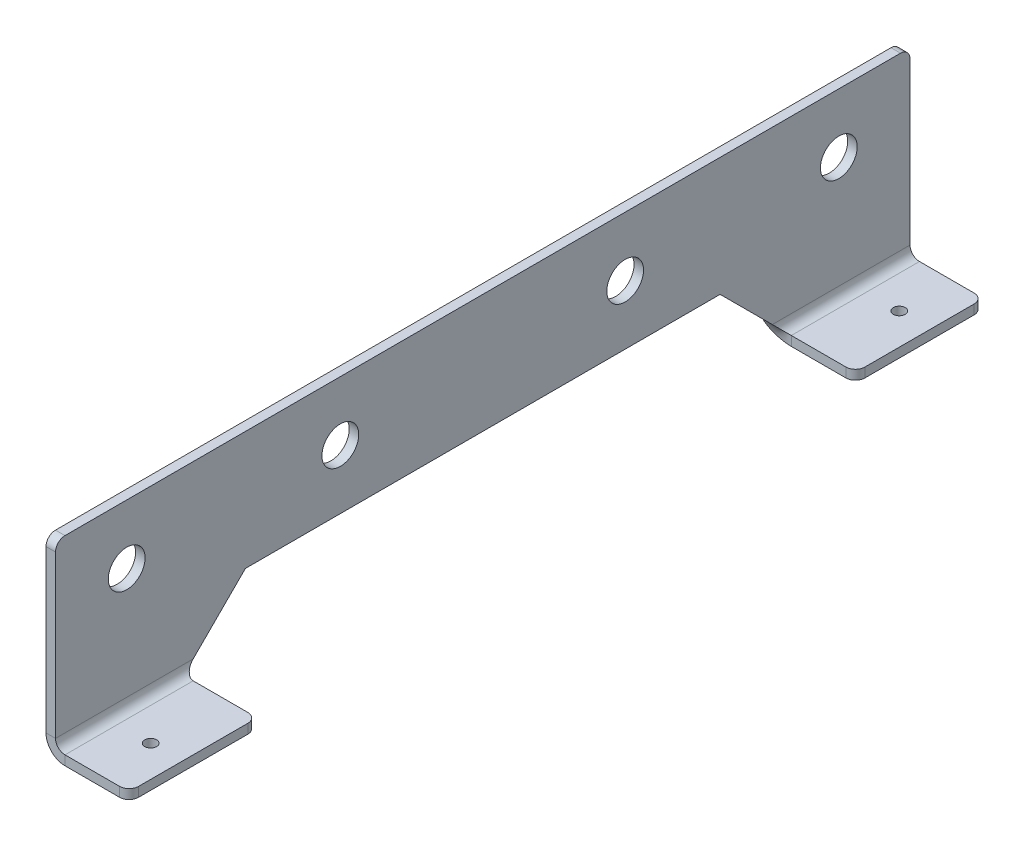
ISO-10303-21;
HEADER;
FILE_DESCRIPTION(('STEP AP214'),'2;1');
FILE_NAME('part.step','',(''),(''),'','','');
FILE_SCHEMA(('AUTOMOTIVE_DESIGN { 1 0 10303 214 1 1 1 1 }'));
ENDSEC;
DATA;
#1=APPLICATION_CONTEXT('core data for automotive mechanical design processes');
#2=APPLICATION_PROTOCOL_DEFINITION('international standard','automotive_design',2000,#1);
#3=PRODUCT_CONTEXT('',#1,'mechanical');
#4=PRODUCT('Part','Part','',(#3));
#5=PRODUCT_RELATED_PRODUCT_CATEGORY('part','',(#4));
#6=PRODUCT_DEFINITION_FORMATION('','',#4);
#7=PRODUCT_DEFINITION_CONTEXT('part definition',#1,'design');
#8=PRODUCT_DEFINITION('design','',#6,#7);
#9=PRODUCT_DEFINITION_SHAPE('','',#8);
#10=(LENGTH_UNIT() NAMED_UNIT(*) SI_UNIT(.MILLI.,.METRE.));
#11=(NAMED_UNIT(*) PLANE_ANGLE_UNIT() SI_UNIT($,.RADIAN.));
#12=(NAMED_UNIT(*) SI_UNIT($,.STERADIAN.) SOLID_ANGLE_UNIT());
#13=UNCERTAINTY_MEASURE_WITH_UNIT(LENGTH_MEASURE(1.E-05),#10,'distance_accuracy_value','');
#14=(GEOMETRIC_REPRESENTATION_CONTEXT(3) GLOBAL_UNCERTAINTY_ASSIGNED_CONTEXT((#13)) GLOBAL_UNIT_ASSIGNED_CONTEXT((#10,
#11,#12)) REPRESENTATION_CONTEXT('',''));
#15=CARTESIAN_POINT('',(0.,0.,0.));
#16=DIRECTION('',(0.,0.,1.));
#17=DIRECTION('',(1.,0.,0.));
#18=AXIS2_PLACEMENT_3D('',#15,#16,#17);
#19=CARTESIAN_POINT('',(4.,-76.,0.));
#20=DIRECTION('',(0.,0.,1.));
#21=DIRECTION('',(0.,1.,0.));
#22=AXIS2_PLACEMENT_3D('',#19,#20,#21);
#23=PLANE('',#22);
#24=DIRECTION('',(0.,-1.,0.));
#25=VECTOR('',#24,1.);
#26=CARTESIAN_POINT('',(0.,-76.,1.11022302462516E-13));
#27=LINE('',#26,#25);
#28=CARTESIAN_POINT('',(0.,-72.,0.));
#29=VERTEX_POINT('',#28);
#30=CARTESIAN_POINT('',(0.,-4.,1.11022302462516E-13));
#31=VERTEX_POINT('',#30);
#32=EDGE_CURVE('E292',#29,#31,#27,.F.);
#33=ORIENTED_EDGE('',*,*,#32,.T.);
#34=DIRECTION('',(1.,0.,0.));
#35=VECTOR('',#34,1.);
#36=CARTESIAN_POINT('',(4.,-4.,0.));
#37=LINE('',#36,#35);
#38=CARTESIAN_POINT('',(4.,-4.,0.));
#39=VERTEX_POINT('',#38);
#40=EDGE_CURVE('E364',#31,#39,#37,.T.);
#41=ORIENTED_EDGE('',*,*,#40,.T.);
#42=DIRECTION('',(0.,1.,0.));
#43=VECTOR('',#42,1.);
#44=CARTESIAN_POINT('',(4.,-76.,0.));
#45=LINE('',#44,#43);
#46=CARTESIAN_POINT('',(4.,-72.,0.));
#47=VERTEX_POINT('',#46);
#48=EDGE_CURVE('E214',#47,#39,#45,.T.);
#49=ORIENTED_EDGE('',*,*,#48,.F.);
#50=DIRECTION('',(1.,0.,0.));
#51=VECTOR('',#50,1.);
#52=CARTESIAN_POINT('',(4.,-72.,0.));
#53=LINE('',#52,#51);
#54=EDGE_CURVE('E345',#29,#47,#53,.T.);
#55=ORIENTED_EDGE('',*,*,#54,.F.);
#56=EDGE_LOOP('',(#33,#41,#49,#55));
#57=FACE_BOUND('',#56,.T.);
#58=ADVANCED_FACE('F36',(#57),#23,.F.);
#59=CARTESIAN_POINT('',(4.,0.,360.));
#60=DIRECTION('',(0.,1.,0.));
#61=DIRECTION('',(0.,0.,-1.));
#62=AXIS2_PLACEMENT_3D('',#59,#60,#61);
#63=PLANE('',#62);
#64=DIRECTION('',(0.,0.,1.));
#65=VECTOR('',#64,1.);
#66=CARTESIAN_POINT('',(0.,0.,360.));
#67=LINE('',#66,#65);
#68=CARTESIAN_POINT('',(0.,0.,356.));
#69=VERTEX_POINT('',#68);
#70=CARTESIAN_POINT('',(0.,0.,4.00000000000011));
#71=VERTEX_POINT('',#70);
#72=EDGE_CURVE('E313',#69,#71,#67,.F.);
#73=ORIENTED_EDGE('',*,*,#72,.F.);
#74=DIRECTION('',(1.,0.,0.));
#75=VECTOR('',#74,1.);
#76=CARTESIAN_POINT('',(4.,0.,356.));
#77=LINE('',#76,#75);
#78=CARTESIAN_POINT('',(4.,0.,356.));
#79=VERTEX_POINT('',#78);
#80=EDGE_CURVE('E351',#69,#79,#77,.T.);
#81=ORIENTED_EDGE('',*,*,#80,.T.);
#82=DIRECTION('',(0.,0.,-1.));
#83=VECTOR('',#82,1.);
#84=CARTESIAN_POINT('',(4.,0.,360.));
#85=LINE('',#84,#83);
#86=CARTESIAN_POINT('',(4.,0.,4.00000000000011));
#87=VERTEX_POINT('',#86);
#88=EDGE_CURVE('E217',#79,#87,#85,.T.);
#89=ORIENTED_EDGE('',*,*,#88,.T.);
#90=DIRECTION('',(-1.,0.,0.));
#91=VECTOR('',#90,1.);
#92=CARTESIAN_POINT('',(4.,0.,4.));
#93=LINE('',#92,#91);
#94=EDGE_CURVE('E347',#87,#71,#93,.T.);
#95=ORIENTED_EDGE('',*,*,#94,.T.);
#96=EDGE_LOOP('',(#73,#81,#89,#95));
#97=FACE_BOUND('',#96,.T.);
#98=ADVANCED_FACE('F443',(#97),#63,.T.);
#99=CARTESIAN_POINT('',(4.,-76.,360.));
#100=DIRECTION('',(0.,0.,1.));
#101=DIRECTION('',(0.,1.,0.));
#102=AXIS2_PLACEMENT_3D('',#99,#100,#101);
#103=PLANE('',#102);
#104=DIRECTION('',(0.,1.,0.));
#105=VECTOR('',#104,1.);
#106=CARTESIAN_POINT('',(4.,-76.,360.));
#107=LINE('',#106,#105);
#108=CARTESIAN_POINT('',(4.,-72.,360.));
#109=VERTEX_POINT('',#108);
#110=CARTESIAN_POINT('',(4.,-4.,360.));
#111=VERTEX_POINT('',#110);
#112=EDGE_CURVE('E223',#109,#111,#107,.T.);
#113=ORIENTED_EDGE('',*,*,#112,.T.);
#114=DIRECTION('',(1.,0.,0.));
#115=VECTOR('',#114,1.);
#116=CARTESIAN_POINT('',(4.,-4.,360.));
#117=LINE('',#116,#115);
#118=CARTESIAN_POINT('',(0.,-4.,360.));
#119=VERTEX_POINT('',#118);
#120=EDGE_CURVE('E358',#111,#119,#117,.F.);
#121=ORIENTED_EDGE('',*,*,#120,.T.);
#122=DIRECTION('',(0.,-1.,0.));
#123=VECTOR('',#122,1.);
#124=CARTESIAN_POINT('',(0.,-76.,360.));
#125=LINE('',#124,#123);
#126=CARTESIAN_POINT('',(0.,-72.,360.));
#127=VERTEX_POINT('',#126);
#128=EDGE_CURVE('E299',#127,#119,#125,.F.);
#129=ORIENTED_EDGE('',*,*,#128,.F.);
#130=DIRECTION('',(1.,0.,0.));
#131=VECTOR('',#130,1.);
#132=CARTESIAN_POINT('',(4.,-72.,360.));
#133=LINE('',#132,#131);
#134=EDGE_CURVE('E343',#127,#109,#133,.T.);
#135=ORIENTED_EDGE('',*,*,#134,.T.);
#136=EDGE_LOOP('',(#113,#121,#129,#135));
#137=FACE_BOUND('',#136,.T.);
#138=ADVANCED_FACE('F432',(#137),#103,.T.);
#139=CARTESIAN_POINT('',(8.,-72.,360.));
#140=DIRECTION('',(0.,0.,1.));
#141=DIRECTION('',(1.,0.,0.));
#142=AXIS2_PLACEMENT_3D('',#139,#140,#141);
#143=PLANE('',#142);
#144=ORIENTED_EDGE('',*,*,#134,.F.);
#145=CARTESIAN_POINT('',(8.,-72.,360.));
#146=DIRECTION('',(0.,0.,1.));
#147=DIRECTION('',(1.,0.,0.));
#148=AXIS2_PLACEMENT_3D('',#145,#146,#147);
#149=CIRCLE('',#148,8.);
#150=CARTESIAN_POINT('',(8.00000000000001,-80.,360.));
#151=VERTEX_POINT('',#150);
#152=EDGE_CURVE('E302',#127,#151,#149,.T.);
#153=ORIENTED_EDGE('',*,*,#152,.T.);
#154=DIRECTION('',(0.,1.,0.));
#155=VECTOR('',#154,1.);
#156=CARTESIAN_POINT('',(8.00000000000001,-76.,360.));
#157=LINE('',#156,#155);
#158=CARTESIAN_POINT('',(8.00000000000001,-76.,360.));
#159=VERTEX_POINT('',#158);
#160=EDGE_CURVE('E340',#151,#159,#157,.T.);
#161=ORIENTED_EDGE('',*,*,#160,.T.);
#162=CARTESIAN_POINT('',(8.,-72.,360.));
#163=DIRECTION('',(0.,0.,-1.));
#164=DIRECTION('',(-1.,0.,0.));
#165=AXIS2_PLACEMENT_3D('',#162,#163,#164);
#166=CIRCLE('',#165,4.);
#167=EDGE_CURVE('E249',#109,#159,#166,.F.);
#168=ORIENTED_EDGE('',*,*,#167,.F.);
#169=EDGE_LOOP('',(#144,#153,#161,#168));
#170=FACE_BOUND('',#169,.T.);
#171=ADVANCED_FACE('F423',(#170),#143,.T.);
#172=CARTESIAN_POINT('',(35.,-76.,360.));
#173=DIRECTION('',(0.,0.,1.));
#174=DIRECTION('',(-1.,0.,0.));
#175=AXIS2_PLACEMENT_3D('',#172,#173,#174);
#176=PLANE('',#175);
#177=DIRECTION('',(1.,0.,0.));
#178=VECTOR('',#177,1.);
#179=CARTESIAN_POINT('',(35.,-80.,360.));
#180=LINE('',#179,#178);
#181=CARTESIAN_POINT('',(31.,-80.,360.));
#182=VERTEX_POINT('',#181);
#183=EDGE_CURVE('E284',#182,#151,#180,.F.);
#184=ORIENTED_EDGE('',*,*,#183,.F.);
#185=DIRECTION('',(0.,-1.,0.));
#186=VECTOR('',#185,1.);
#187=CARTESIAN_POINT('',(31.,-76.,360.));
#188=LINE('',#187,#186);
#189=CARTESIAN_POINT('',(31.,-76.,360.));
#190=VERTEX_POINT('',#189);
#191=EDGE_CURVE('E11',#182,#190,#188,.F.);
#192=ORIENTED_EDGE('',*,*,#191,.T.);
#193=DIRECTION('',(-1.,0.,0.));
#194=VECTOR('',#193,1.);
#195=CARTESIAN_POINT('',(35.,-76.,360.));
#196=LINE('',#195,#194);
#197=EDGE_CURVE('E233',#190,#159,#196,.T.);
#198=ORIENTED_EDGE('',*,*,#197,.T.);
#199=ORIENTED_EDGE('',*,*,#160,.F.);
#200=EDGE_LOOP('',(#184,#192,#198,#199));
#201=FACE_BOUND('',#200,.T.);
#202=ADVANCED_FACE('F420',(#201),#176,.T.);
#203=CARTESIAN_POINT('',(35.,-76.,360.));
#204=DIRECTION('',(-1.,0.,0.));
#205=DIRECTION('',(0.,0.,-1.));
#206=AXIS2_PLACEMENT_3D('',#203,#204,#205);
#207=PLANE('',#206);
#208=DIRECTION('',(0.,0.,1.));
#209=VECTOR('',#208,1.);
#210=CARTESIAN_POINT('',(35.,-80.,360.));
#211=LINE('',#210,#209);
#212=CARTESIAN_POINT('',(35.,-80.,356.));
#213=VERTEX_POINT('',#212);
#214=CARTESIAN_POINT('',(35.,-80.,310.));
#215=VERTEX_POINT('',#214);
#216=EDGE_CURVE('E298',#213,#215,#211,.F.);
#217=ORIENTED_EDGE('',*,*,#216,.T.);
#218=DIRECTION('',(0.,-1.,0.));
#219=VECTOR('',#218,1.);
#220=CARTESIAN_POINT('',(35.,-76.,310.));
#221=LINE('',#220,#219);
#222=CARTESIAN_POINT('',(35.,-76.,310.));
#223=VERTEX_POINT('',#222);
#224=EDGE_CURVE('E387',#215,#223,#221,.F.);
#225=ORIENTED_EDGE('',*,*,#224,.T.);
#226=DIRECTION('',(0.,0.,-1.));
#227=VECTOR('',#226,1.);
#228=CARTESIAN_POINT('',(35.,-76.,360.));
#229=LINE('',#228,#227);
#230=CARTESIAN_POINT('',(35.,-76.,356.));
#231=VERTEX_POINT('',#230);
#232=EDGE_CURVE('E227',#231,#223,#229,.T.);
#233=ORIENTED_EDGE('',*,*,#232,.F.);
#234=DIRECTION('',(0.,1.,0.));
#235=VECTOR('',#234,1.);
#236=CARTESIAN_POINT('',(35.,-76.,356.));
#237=LINE('',#236,#235);
#238=EDGE_CURVE('E385',#231,#213,#237,.F.);
#239=ORIENTED_EDGE('',*,*,#238,.T.);
#240=EDGE_LOOP('',(#217,#225,#233,#239));
#241=FACE_BOUND('',#240,.T.);
#242=ADVANCED_FACE('F401',(#241),#207,.F.);
#243=CARTESIAN_POINT('',(35.,-76.,306.));
#244=DIRECTION('',(0.,0.,1.));
#245=DIRECTION('',(-1.,0.,0.));
#246=AXIS2_PLACEMENT_3D('',#243,#244,#245);
#247=PLANE('',#246);
#248=DIRECTION('',(-1.,0.,0.));
#249=VECTOR('',#248,1.);
#250=CARTESIAN_POINT('',(35.,-76.,306.));
#251=LINE('',#250,#249);
#252=CARTESIAN_POINT('',(31.,-76.,306.));
#253=VERTEX_POINT('',#252);
#254=CARTESIAN_POINT('',(8.00000000000001,-76.,306.));
#255=VERTEX_POINT('',#254);
#256=EDGE_CURVE('E230',#253,#255,#251,.T.);
#257=ORIENTED_EDGE('',*,*,#256,.F.);
#258=DIRECTION('',(0.,-1.,0.));
#259=VECTOR('',#258,1.);
#260=CARTESIAN_POINT('',(31.,-76.,306.));
#261=LINE('',#260,#259);
#262=CARTESIAN_POINT('',(31.,-80.,306.));
#263=VERTEX_POINT('',#262);
#264=EDGE_CURVE('E59',#253,#263,#261,.T.);
#265=ORIENTED_EDGE('',*,*,#264,.T.);
#266=DIRECTION('',(1.,0.,0.));
#267=VECTOR('',#266,1.);
#268=CARTESIAN_POINT('',(35.,-80.,306.));
#269=LINE('',#268,#267);
#270=CARTESIAN_POINT('',(8.00000000000001,-80.,306.));
#271=VERTEX_POINT('',#270);
#272=EDGE_CURVE('E303',#263,#271,#269,.F.);
#273=ORIENTED_EDGE('',*,*,#272,.T.);
#274=DIRECTION('',(0.,1.,0.));
#275=VECTOR('',#274,1.);
#276=CARTESIAN_POINT('',(8.00000000000001,-76.,306.));
#277=LINE('',#276,#275);
#278=EDGE_CURVE('E337',#271,#255,#277,.T.);
#279=ORIENTED_EDGE('',*,*,#278,.T.);
#280=EDGE_LOOP('',(#257,#265,#273,#279));
#281=FACE_BOUND('',#280,.T.);
#282=ADVANCED_FACE('F407',(#281),#247,.F.);
#283=CARTESIAN_POINT('',(8.,-80.,306.));
#284=CARTESIAN_POINT('',(8.,-78.6666666666667,306.));
#285=CARTESIAN_POINT('',(8.,-77.3333333333334,306.));
#286=CARTESIAN_POINT('',(8.,-76.,306.));
#287=CARTESIAN_POINT('',(-7.99999999999999,-80.,306.));
#288=CARTESIAN_POINT('',(-5.33333333333333,-78.6666666666667,306.));
#289=CARTESIAN_POINT('',(-2.66666666666666,-77.3333333333334,306.));
#290=CARTESIAN_POINT('',(0.,-76.,306.));
#291=CARTESIAN_POINT('',(-7.99999999999999,-64.,298.));
#292=CARTESIAN_POINT('',(-5.33333333333332,-65.3333333333333,298.));
#293=CARTESIAN_POINT('',(-2.66666666666666,-66.6666666666667,298.));
#294=CARTESIAN_POINT('',(0.,-68.,298.));
#295=CARTESIAN_POINT('',(8.00000000000001,-64.,298.));
#296=CARTESIAN_POINT('',(8.00000000000001,-65.3333333333333,298.));
#297=CARTESIAN_POINT('',(8.,-66.6666666666667,298.));
#298=CARTESIAN_POINT('',(8.,-68.,298.));
#299=CARTESIAN_POINT('',(24.,-64.,298.));
#300=CARTESIAN_POINT('',(21.3333333333333,-65.3333333333333,298.));
#301=CARTESIAN_POINT('',(18.6666666666667,-66.6666666666667,298.));
#302=CARTESIAN_POINT('',(16.,-68.,298.));
#303=CARTESIAN_POINT('',(24.,-80.,306.));
#304=CARTESIAN_POINT('',(21.3333333333333,-78.6666666666667,306.));
#305=CARTESIAN_POINT('',(18.6666666666667,-77.3333333333334,306.));
#306=CARTESIAN_POINT('',(16.,-76.,306.));
#307=CARTESIAN_POINT('',(8.,-80.,306.));
#308=CARTESIAN_POINT('',(8.,-78.6666666666667,306.));
#309=CARTESIAN_POINT('',(8.,-77.3333333333334,306.));
#310=CARTESIAN_POINT('',(8.,-76.,306.));
#311=(BOUNDED_SURFACE() B_SPLINE_SURFACE(3,3,((#283,#284,#285,#286),(#287,#288,#289,#290),(#291,
#292,#293,#294),(#295,#296,#297,#298),(#299,#300,#301,#302),(#303,#304,#305,#306),(#307,#308,
#309,#310)),.UNSPECIFIED.,.T.,.F.,.F.) B_SPLINE_SURFACE_WITH_KNOTS((4,3,4),(4,4),(0.,0.5,1.),
(0.,1.),.UNSPECIFIED.) GEOMETRIC_REPRESENTATION_ITEM() RATIONAL_B_SPLINE_SURFACE(((1.,1.,1.,1.),
(0.333333333333333,0.333333333333333,0.333333333333333,0.333333333333333),(0.333333333333333,
0.333333333333333,0.333333333333333,0.333333333333333),(1.,1.,1.,1.),(0.333333333333333,
0.333333333333333,0.333333333333333,0.333333333333333),(0.333333333333333,0.333333333333333,
0.333333333333333,0.333333333333333),(1.,1.,1.,1.))) REPRESENTATION_ITEM('') SURFACE());
#312=CARTESIAN_POINT('',(8.,-72.,302.));
#313=DIRECTION('',(0.,0.447213595499963,0.894427190999913));
#314=DIRECTION('',(0.,-0.894427190999913,0.447213595499963));
#315=AXIS2_PLACEMENT_3D('',#312,#313,#314);
#316=ELLIPSE('',#315,8.94427190999919,8.);
#317=CARTESIAN_POINT('',(0.,-72.,302.));
#318=VERTEX_POINT('',#317);
#319=EDGE_CURVE('E288',#271,#318,#316,.F.);
#320=DIRECTION('',(1.,0.,0.));
#321=VECTOR('',#320,1.);
#322=CARTESIAN_POINT('',(4.,-72.,302.));
#323=LINE('',#322,#321);
#324=CARTESIAN_POINT('',(4.,-72.,302.));
#325=VERTEX_POINT('',#324);
#326=EDGE_CURVE('E335',#318,#325,#323,.T.);
#327=CARTESIAN_POINT('',(8.,-72.,302.));
#328=DIRECTION('',(0.,0.707106781186551,0.707106781186544));
#329=DIRECTION('',(0.,-0.707106781186544,0.707106781186551));
#330=AXIS2_PLACEMENT_3D('',#327,#328,#329);
#331=ELLIPSE('',#330,5.65685424949241,4.);
#332=EDGE_CURVE('E246',#255,#325,#331,.F.);
#333=ORIENTED_EDGE('',*,*,#278,.F.);
#334=ORIENTED_EDGE('',*,*,#319,.T.);
#335=ORIENTED_EDGE('',*,*,#326,.T.);
#336=ORIENTED_EDGE('',*,*,#332,.F.);
#337=EDGE_LOOP('',(#333,#334,#335,#336));
#338=FACE_BOUND('',#337,.T.);
#339=ADVANCED_FACE('F412',(#338),#311,.T.);
#340=CARTESIAN_POINT('',(4.,-103.,333.));
#341=DIRECTION('',(0.,0.707106781186551,0.707106781186544));
#342=DIRECTION('',(0.,0.707106781186544,-0.707106781186551));
#343=AXIS2_PLACEMENT_3D('',#340,#341,#342);
#344=PLANE('',#343);
#345=ORIENTED_EDGE('',*,*,#326,.F.);
#346=DIRECTION('',(0.,0.707106781186544,-0.707106781186551));
#347=VECTOR('',#346,1.);
#348=CARTESIAN_POINT('',(0.,-103.,333.));
#349=LINE('',#348,#347);
#350=CARTESIAN_POINT('',(0.,-50.,280.));
#351=VERTEX_POINT('',#350);
#352=EDGE_CURVE('E295',#318,#351,#349,.T.);
#353=ORIENTED_EDGE('',*,*,#352,.T.);
#354=DIRECTION('',(1.,0.,0.));
#355=VECTOR('',#354,1.);
#356=CARTESIAN_POINT('',(4.,-50.,280.));
#357=LINE('',#356,#355);
#358=CARTESIAN_POINT('',(4.,-50.,280.));
#359=VERTEX_POINT('',#358);
#360=EDGE_CURVE('E197',#351,#359,#357,.T.);
#361=ORIENTED_EDGE('',*,*,#360,.T.);
#362=DIRECTION('',(0.,0.707106781186544,-0.707106781186551));
#363=VECTOR('',#362,1.);
#364=CARTESIAN_POINT('',(4.,-103.,333.));
#365=LINE('',#364,#363);
#366=EDGE_CURVE('E210',#325,#359,#365,.T.);
#367=ORIENTED_EDGE('',*,*,#366,.F.);
#368=EDGE_LOOP('',(#345,#353,#361,#367));
#369=FACE_BOUND('',#368,.T.);
#370=ADVANCED_FACE('F465',(#369),#344,.F.);
#371=CARTESIAN_POINT('',(4.,-50.,360.));
#372=DIRECTION('',(0.,1.,0.));
#373=DIRECTION('',(0.,0.,-1.));
#374=AXIS2_PLACEMENT_3D('',#371,#372,#373);
#375=PLANE('',#374);
#376=ORIENTED_EDGE('',*,*,#360,.F.);
#377=DIRECTION('',(0.,0.,1.));
#378=VECTOR('',#377,1.);
#379=CARTESIAN_POINT('',(0.,-50.,360.));
#380=LINE('',#379,#378);
#381=CARTESIAN_POINT('',(0.,-50.,80.0000000000004));
#382=VERTEX_POINT('',#381);
#383=EDGE_CURVE('E192',#351,#382,#380,.F.);
#384=ORIENTED_EDGE('',*,*,#383,.T.);
#385=DIRECTION('',(1.,0.,0.));
#386=VECTOR('',#385,1.);
#387=CARTESIAN_POINT('',(4.,-50.,80.0000000000003));
#388=LINE('',#387,#386);
#389=CARTESIAN_POINT('',(4.,-50.,80.0000000000003));
#390=VERTEX_POINT('',#389);
#391=EDGE_CURVE('E187',#382,#390,#388,.T.);
#392=ORIENTED_EDGE('',*,*,#391,.T.);
#393=DIRECTION('',(0.,0.,-1.));
#394=VECTOR('',#393,1.);
#395=CARTESIAN_POINT('',(4.,-50.,360.));
#396=LINE('',#395,#394);
#397=EDGE_CURVE('E190',#359,#390,#396,.T.);
#398=ORIENTED_EDGE('',*,*,#397,.F.);
#399=EDGE_LOOP('',(#376,#384,#392,#398));
#400=FACE_BOUND('',#399,.T.);
#401=ADVANCED_FACE('F189',(#400),#375,.F.);
#402=CARTESIAN_POINT('',(4.,77.,207.000000000002));
#403=DIRECTION('',(0.,0.707106781186551,-0.707106781186544));
#404=DIRECTION('',(0.,-0.707106781186544,-0.707106781186551));
#405=AXIS2_PLACEMENT_3D('',#402,#403,#404);
#406=PLANE('',#405);
#407=ORIENTED_EDGE('',*,*,#391,.F.);
#408=DIRECTION('',(0.,-0.707106781186544,-0.707106781186551));
#409=VECTOR('',#408,1.);
#410=CARTESIAN_POINT('',(0.,77.,207.000000000002));
#411=LINE('',#410,#409);
#412=CARTESIAN_POINT('',(0.,-72.,58.0000000000002));
#413=VERTEX_POINT('',#412);
#414=EDGE_CURVE('E290',#382,#413,#411,.T.);
#415=ORIENTED_EDGE('',*,*,#414,.T.);
#416=DIRECTION('',(1.,0.,0.));
#417=VECTOR('',#416,1.);
#418=CARTESIAN_POINT('',(4.,-72.,58.0000000000001));
#419=LINE('',#418,#417);
#420=CARTESIAN_POINT('',(4.,-72.,58.0000000000001));
#421=VERTEX_POINT('',#420);
#422=EDGE_CURVE('E198',#413,#421,#419,.T.);
#423=ORIENTED_EDGE('',*,*,#422,.T.);
#424=DIRECTION('',(0.,-0.707106781186544,-0.707106781186551));
#425=VECTOR('',#424,1.);
#426=CARTESIAN_POINT('',(4.,77.,207.000000000002));
#427=LINE('',#426,#425);
#428=EDGE_CURVE('E206',#390,#421,#427,.T.);
#429=ORIENTED_EDGE('',*,*,#428,.F.);
#430=EDGE_LOOP('',(#407,#415,#423,#429));
#431=FACE_BOUND('',#430,.T.);
#432=ADVANCED_FACE('F213',(#431),#406,.F.);
#433=CARTESIAN_POINT('',(8.,-64.,62.0000000000001));
#434=CARTESIAN_POINT('',(8.,-65.3333333333333,62.0000000000001));
#435=CARTESIAN_POINT('',(8.,-66.6666666666667,62.0000000000001));
#436=CARTESIAN_POINT('',(8.,-68.,62.0000000000001));
#437=CARTESIAN_POINT('',(-7.99999999999999,-64.,62.0000000000001));
#438=CARTESIAN_POINT('',(-5.33333333333333,-65.3333333333334,62.0000000000002));
#439=CARTESIAN_POINT('',(-2.66666666666666,-66.6666666666667,62.0000000000002));
#440=CARTESIAN_POINT('',(0.,-68.,62.0000000000001));
#441=CARTESIAN_POINT('',(-7.99999999999999,-80.,54.0000000000001));
#442=CARTESIAN_POINT('',(-5.33333333333333,-78.6666666666667,54.0000000000001));
#443=CARTESIAN_POINT('',(-2.66666666666666,-77.3333333333334,54.0000000000001));
#444=CARTESIAN_POINT('',(0.,-76.,54.0000000000001));
#445=CARTESIAN_POINT('',(8.00000000000001,-80.,54.0000000000001));
#446=CARTESIAN_POINT('',(8.00000000000001,-78.6666666666667,54.0000000000001));
#447=CARTESIAN_POINT('',(8.,-77.3333333333334,54.0000000000001));
#448=CARTESIAN_POINT('',(8.,-76.,54.0000000000001));
#449=CARTESIAN_POINT('',(24.,-80.,54.0000000000001));
#450=CARTESIAN_POINT('',(21.3333333333333,-78.6666666666667,54.0000000000001));
#451=CARTESIAN_POINT('',(18.6666666666667,-77.3333333333334,54.0000000000001));
#452=CARTESIAN_POINT('',(16.,-76.,54.0000000000001));
#453=CARTESIAN_POINT('',(24.,-64.,62.0000000000001));
#454=CARTESIAN_POINT('',(21.3333333333333,-65.3333333333334,62.0000000000002));
#455=CARTESIAN_POINT('',(18.6666666666667,-66.6666666666667,62.0000000000002));
#456=CARTESIAN_POINT('',(16.,-68.,62.0000000000001));
#457=CARTESIAN_POINT('',(8.,-64.,62.0000000000001));
#458=CARTESIAN_POINT('',(8.,-65.3333333333333,62.0000000000001));
#459=CARTESIAN_POINT('',(8.,-66.6666666666667,62.0000000000001));
#460=CARTESIAN_POINT('',(8.,-68.,62.0000000000001));
#461=(BOUNDED_SURFACE() B_SPLINE_SURFACE(3,3,((#433,#434,#435,#436),(#437,#438,#439,#440),(#441,
#442,#443,#444),(#445,#446,#447,#448),(#449,#450,#451,#452),(#453,#454,#455,#456),(#457,#458,
#459,#460)),.UNSPECIFIED.,.T.,.F.,.F.) B_SPLINE_SURFACE_WITH_KNOTS((4,3,4),(4,4),(0.,0.5,1.),
(0.,1.),.UNSPECIFIED.) GEOMETRIC_REPRESENTATION_ITEM() RATIONAL_B_SPLINE_SURFACE(((1.,1.,1.,1.),
(0.333333333333333,0.333333333333333,0.333333333333333,0.333333333333333),(0.333333333333333,
0.333333333333333,0.333333333333333,0.333333333333333),(1.,1.,1.,1.),(0.333333333333333,
0.333333333333333,0.333333333333333,0.333333333333333),(0.333333333333333,0.333333333333333,
0.333333333333333,0.333333333333333),(1.,1.,1.,1.))) REPRESENTATION_ITEM('') SURFACE());
#462=CARTESIAN_POINT('',(8.,-72.,58.0000000000001));
#463=DIRECTION('',(0.,0.44721359549996,-0.894427190999915));
#464=DIRECTION('',(0.,0.894427190999915,0.44721359549996));
#465=AXIS2_PLACEMENT_3D('',#462,#463,#464);
#466=ELLIPSE('',#465,8.94427190999918,8.);
#467=CARTESIAN_POINT('',(8.00000000000001,-80.,54.));
#468=VERTEX_POINT('',#467);
#469=EDGE_CURVE('E285',#413,#468,#466,.F.);
#470=DIRECTION('',(0.,1.,0.));
#471=VECTOR('',#470,1.);
#472=CARTESIAN_POINT('',(8.00000000000001,-76.,54.));
#473=LINE('',#472,#471);
#474=CARTESIAN_POINT('',(8.00000000000001,-76.,54.));
#475=VERTEX_POINT('',#474);
#476=EDGE_CURVE('E331',#468,#475,#473,.T.);
#477=CARTESIAN_POINT('',(8.,-72.,58.0000000000001));
#478=DIRECTION('',(0.,0.707106781186551,-0.707106781186544));
#479=DIRECTION('',(0.,0.707106781186544,0.707106781186551));
#480=AXIS2_PLACEMENT_3D('',#477,#478,#479);
#481=ELLIPSE('',#480,5.65685424949241,4.);
#482=EDGE_CURVE('E250',#421,#475,#481,.F.);
#483=ORIENTED_EDGE('',*,*,#422,.F.);
#484=ORIENTED_EDGE('',*,*,#469,.T.);
#485=ORIENTED_EDGE('',*,*,#476,.T.);
#486=ORIENTED_EDGE('',*,*,#482,.F.);
#487=EDGE_LOOP('',(#483,#484,#485,#486));
#488=FACE_BOUND('',#487,.T.);
#489=ADVANCED_FACE('F567',(#488),#461,.T.);
#490=CARTESIAN_POINT('',(35.0000000000001,-76.,54.));
#491=DIRECTION('',(0.,0.,-1.));
#492=DIRECTION('',(1.,0.,0.));
#493=AXIS2_PLACEMENT_3D('',#490,#491,#492);
#494=PLANE('',#493);
#495=DIRECTION('',(1.,0.,0.));
#496=VECTOR('',#495,1.);
#497=CARTESIAN_POINT('',(35.,-80.,54.0000000000002));
#498=LINE('',#497,#496);
#499=CARTESIAN_POINT('',(31.,-80.,54.0000000000002));
#500=VERTEX_POINT('',#499);
#501=EDGE_CURVE('E281',#468,#500,#498,.T.);
#502=ORIENTED_EDGE('',*,*,#501,.T.);
#503=DIRECTION('',(0.,-1.,0.));
#504=VECTOR('',#503,1.);
#505=CARTESIAN_POINT('',(31.,-76.,54.));
#506=LINE('',#505,#504);
#507=CARTESIAN_POINT('',(31.,-76.,54.));
#508=VERTEX_POINT('',#507);
#509=EDGE_CURVE('E382',#500,#508,#506,.F.);
#510=ORIENTED_EDGE('',*,*,#509,.T.);
#511=DIRECTION('',(1.,0.,0.));
#512=VECTOR('',#511,1.);
#513=CARTESIAN_POINT('',(35.0000000000001,-76.,54.));
#514=LINE('',#513,#512);
#515=EDGE_CURVE('E235',#475,#508,#514,.T.);
#516=ORIENTED_EDGE('',*,*,#515,.F.);
#517=ORIENTED_EDGE('',*,*,#476,.F.);
#518=EDGE_LOOP('',(#502,#510,#516,#517));
#519=FACE_BOUND('',#518,.T.);
#520=ADVANCED_FACE('F563',(#519),#494,.F.);
#521=DIRECTION('',(0.,0.,1.));
#522=VECTOR('',#521,1.);
#523=CARTESIAN_POINT('',(35.,-80.,360.));
#524=LINE('',#523,#522);
#525=CARTESIAN_POINT('',(35.,-80.,50.0000000000002));
#526=VERTEX_POINT('',#525);
#527=CARTESIAN_POINT('',(35.,-80.,4.00000000000011));
#528=VERTEX_POINT('',#527);
#529=EDGE_CURVE('E278',#526,#528,#524,.F.);
#530=ORIENTED_EDGE('',*,*,#529,.T.);
#531=DIRECTION('',(0.,-1.,0.));
#532=VECTOR('',#531,1.);
#533=CARTESIAN_POINT('',(35.,-76.,4.));
#534=LINE('',#533,#532);
#535=CARTESIAN_POINT('',(35.,-76.,4.00000000000011));
#536=VERTEX_POINT('',#535);
#537=EDGE_CURVE('E369',#528,#536,#534,.F.);
#538=ORIENTED_EDGE('',*,*,#537,.T.);
#539=CARTESIAN_POINT('',(35.,-76.,50.0000000000002));
#540=VERTEX_POINT('',#539);
#541=EDGE_CURVE('E231',#540,#536,#229,.T.);
#542=ORIENTED_EDGE('',*,*,#541,.F.);
#543=DIRECTION('',(0.,-1.,0.));
#544=VECTOR('',#543,1.);
#545=CARTESIAN_POINT('',(35.,-76.,50.));
#546=LINE('',#545,#544);
#547=EDGE_CURVE('E367',#540,#526,#546,.T.);
#548=ORIENTED_EDGE('',*,*,#547,.T.);
#549=EDGE_LOOP('',(#530,#538,#542,#548));
#550=FACE_BOUND('',#549,.T.);
#551=ADVANCED_FACE('F559',(#550),#207,.F.);
#552=CARTESIAN_POINT('',(35.,-76.,0.));
#553=DIRECTION('',(0.,0.,1.));
#554=DIRECTION('',(-1.,0.,0.));
#555=AXIS2_PLACEMENT_3D('',#552,#553,#554);
#556=PLANE('',#555);
#557=DIRECTION('',(-1.,0.,0.));
#558=VECTOR('',#557,1.);
#559=CARTESIAN_POINT('',(35.,-76.,0.));
#560=LINE('',#559,#558);
#561=CARTESIAN_POINT('',(31.,-76.,0.));
#562=VERTEX_POINT('',#561);
#563=CARTESIAN_POINT('',(8.00000000000001,-76.,0.));
#564=VERTEX_POINT('',#563);
#565=EDGE_CURVE('E238',#562,#564,#560,.T.);
#566=ORIENTED_EDGE('',*,*,#565,.F.);
#567=DIRECTION('',(0.,-1.,0.));
#568=VECTOR('',#567,1.);
#569=CARTESIAN_POINT('',(31.,-76.,0.));
#570=LINE('',#569,#568);
#571=CARTESIAN_POINT('',(31.,-80.,1.11022302462516E-13));
#572=VERTEX_POINT('',#571);
#573=EDGE_CURVE('E376',#562,#572,#570,.T.);
#574=ORIENTED_EDGE('',*,*,#573,.T.);
#575=DIRECTION('',(1.,0.,0.));
#576=VECTOR('',#575,1.);
#577=CARTESIAN_POINT('',(35.,-80.,1.11022302462516E-13));
#578=LINE('',#577,#576);
#579=CARTESIAN_POINT('',(8.00000000000001,-80.,1.11022302462516E-13));
#580=VERTEX_POINT('',#579);
#581=EDGE_CURVE('E274',#572,#580,#578,.F.);
#582=ORIENTED_EDGE('',*,*,#581,.T.);
#583=DIRECTION('',(0.,1.,0.));
#584=VECTOR('',#583,1.);
#585=CARTESIAN_POINT('',(8.00000000000001,-76.,0.));
#586=LINE('',#585,#584);
#587=EDGE_CURVE('E258',#580,#564,#586,.T.);
#588=ORIENTED_EDGE('',*,*,#587,.T.);
#589=EDGE_LOOP('',(#566,#574,#582,#588));
#590=FACE_BOUND('',#589,.T.);
#591=ADVANCED_FACE('F491',(#590),#556,.F.);
#592=CARTESIAN_POINT('',(4.,-25.,330.));
#593=DIRECTION('',(-1.,0.,0.));
#594=DIRECTION('',(0.,-1.,0.));
#595=AXIS2_PLACEMENT_3D('',#592,#593,#594);
#596=CYLINDRICAL_SURFACE('',#595,7.74999999999997);
#597=CARTESIAN_POINT('',(4.,-25.,330.));
#598=DIRECTION('',(1.,0.,0.));
#599=DIRECTION('',(0.,1.,0.));
#600=AXIS2_PLACEMENT_3D('',#597,#598,#599);
#601=CIRCLE('',#600,7.74999999999997);
#602=CARTESIAN_POINT('',(4.,-17.25,330.));
#603=VERTEX_POINT('',#602);
#604=EDGE_CURVE('E253',#603,#603,#601,.T.);
#605=ORIENTED_EDGE('',*,*,#604,.T.);
#606=EDGE_LOOP('',(#605));
#607=FACE_BOUND('',#606,.T.);
#608=CARTESIAN_POINT('',(0.,-25.,330.));
#609=DIRECTION('',(1.,0.,0.));
#610=DIRECTION('',(0.,1.,0.));
#611=AXIS2_PLACEMENT_3D('',#608,#609,#610);
#612=CIRCLE('',#611,7.74999999999997);
#613=CARTESIAN_POINT('',(0.,-17.25,330.));
#614=VERTEX_POINT('',#613);
#615=EDGE_CURVE('E310',#614,#614,#612,.T.);
#616=ORIENTED_EDGE('',*,*,#615,.F.);
#617=EDGE_LOOP('',(#616));
#618=FACE_BOUND('',#617,.T.);
#619=ADVANCED_FACE('F487',(#607,#618),#596,.F.);
#620=CARTESIAN_POINT('',(4.,-25.,240.));
#621=DIRECTION('',(-1.,0.,0.));
#622=DIRECTION('',(0.,-1.,0.));
#623=AXIS2_PLACEMENT_3D('',#620,#621,#622);
#624=CYLINDRICAL_SURFACE('',#623,7.74999999999997);
#625=CARTESIAN_POINT('',(4.,-25.,240.));
#626=DIRECTION('',(1.,0.,0.));
#627=DIRECTION('',(0.,1.,0.));
#628=AXIS2_PLACEMENT_3D('',#625,#626,#627);
#629=CIRCLE('',#628,7.74999999999997);
#630=CARTESIAN_POINT('',(4.,-17.25,240.));
#631=VERTEX_POINT('',#630);
#632=EDGE_CURVE('E941',#631,#631,#629,.T.);
#633=ORIENTED_EDGE('',*,*,#632,.T.);
#634=EDGE_LOOP('',(#633));
#635=FACE_BOUND('',#634,.T.);
#636=CARTESIAN_POINT('',(0.,-25.,240.));
#637=DIRECTION('',(1.,0.,0.));
#638=DIRECTION('',(0.,1.,0.));
#639=AXIS2_PLACEMENT_3D('',#636,#637,#638);
#640=CIRCLE('',#639,7.74999999999997);
#641=CARTESIAN_POINT('',(0.,-17.25,240.));
#642=VERTEX_POINT('',#641);
#643=EDGE_CURVE('E323',#642,#642,#640,.T.);
#644=ORIENTED_EDGE('',*,*,#643,.F.);
#645=EDGE_LOOP('',(#644));
#646=FACE_BOUND('',#645,.T.);
#647=ADVANCED_FACE('F490',(#635,#646),#624,.F.);
#648=CARTESIAN_POINT('',(4.,-25.,120.));
#649=DIRECTION('',(-1.,0.,0.));
#650=DIRECTION('',(0.,-1.,0.));
#651=AXIS2_PLACEMENT_3D('',#648,#649,#650);
#652=CYLINDRICAL_SURFACE('',#651,7.75);
#653=CARTESIAN_POINT('',(4.,-25.,120.));
#654=DIRECTION('',(1.,0.,0.));
#655=DIRECTION('',(0.,1.,0.));
#656=AXIS2_PLACEMENT_3D('',#653,#654,#655);
#657=CIRCLE('',#656,7.75);
#658=CARTESIAN_POINT('',(4.,-17.25,120.));
#659=VERTEX_POINT('',#658);
#660=EDGE_CURVE('E944',#659,#659,#657,.T.);
#661=ORIENTED_EDGE('',*,*,#660,.T.);
#662=EDGE_LOOP('',(#661));
#663=FACE_BOUND('',#662,.T.);
#664=CARTESIAN_POINT('',(0.,-25.,120.));
#665=DIRECTION('',(1.,0.,0.));
#666=DIRECTION('',(0.,1.,0.));
#667=AXIS2_PLACEMENT_3D('',#664,#665,#666);
#668=CIRCLE('',#667,7.75);
#669=CARTESIAN_POINT('',(0.,-17.25,120.));
#670=VERTEX_POINT('',#669);
#671=EDGE_CURVE('E326',#670,#670,#668,.T.);
#672=ORIENTED_EDGE('',*,*,#671,.F.);
#673=EDGE_LOOP('',(#672));
#674=FACE_BOUND('',#673,.T.);
#675=ADVANCED_FACE('F495',(#663,#674),#652,.F.);
#676=CARTESIAN_POINT('',(4.,-25.,30.));
#677=DIRECTION('',(-1.,0.,0.));
#678=DIRECTION('',(0.,-1.,0.));
#679=AXIS2_PLACEMENT_3D('',#676,#677,#678);
#680=CYLINDRICAL_SURFACE('',#679,7.75);
#681=CARTESIAN_POINT('',(4.,-25.,30.));
#682=DIRECTION('',(1.,0.,0.));
#683=DIRECTION('',(0.,1.,0.));
#684=AXIS2_PLACEMENT_3D('',#681,#682,#683);
#685=CIRCLE('',#684,7.75);
#686=CARTESIAN_POINT('',(4.,-17.25,30.));
#687=VERTEX_POINT('',#686);
#688=EDGE_CURVE('E211',#687,#687,#685,.T.);
#689=ORIENTED_EDGE('',*,*,#688,.T.);
#690=EDGE_LOOP('',(#689));
#691=FACE_BOUND('',#690,.T.);
#692=CARTESIAN_POINT('',(0.,-25.,30.));
#693=DIRECTION('',(1.,0.,0.));
#694=DIRECTION('',(0.,1.,0.));
#695=AXIS2_PLACEMENT_3D('',#692,#693,#694);
#696=CIRCLE('',#695,7.75);
#697=CARTESIAN_POINT('',(0.,-17.25,30.));
#698=VERTEX_POINT('',#697);
#699=EDGE_CURVE('E294',#698,#698,#696,.T.);
#700=ORIENTED_EDGE('',*,*,#699,.F.);
#701=EDGE_LOOP('',(#700));
#702=FACE_BOUND('',#701,.T.);
#703=ADVANCED_FACE('F486',(#691,#702),#680,.F.);
#704=CARTESIAN_POINT('',(8.,-72.,0.));
#705=DIRECTION('',(0.,0.,-1.));
#706=DIRECTION('',(-1.,0.,0.));
#707=AXIS2_PLACEMENT_3D('',#704,#705,#706);
#708=PLANE('',#707);
#709=CARTESIAN_POINT('',(8.,-72.,0.));
#710=DIRECTION('',(0.,0.,1.));
#711=DIRECTION('',(1.,0.,0.));
#712=AXIS2_PLACEMENT_3D('',#709,#710,#711);
#713=CIRCLE('',#712,8.);
#714=EDGE_CURVE('E289',#580,#29,#713,.F.);
#715=ORIENTED_EDGE('',*,*,#714,.T.);
#716=ORIENTED_EDGE('',*,*,#54,.T.);
#717=CARTESIAN_POINT('',(8.,-72.,0.));
#718=DIRECTION('',(0.,0.,1.));
#719=DIRECTION('',(1.,0.,0.));
#720=AXIS2_PLACEMENT_3D('',#717,#718,#719);
#721=CIRCLE('',#720,4.);
#722=EDGE_CURVE('E259',#564,#47,#721,.F.);
#723=ORIENTED_EDGE('',*,*,#722,.F.);
#724=ORIENTED_EDGE('',*,*,#587,.F.);
#725=EDGE_LOOP('',(#715,#716,#723,#724));
#726=FACE_BOUND('',#725,.T.);
#727=ADVANCED_FACE('F457',(#726),#708,.T.);
#728=CARTESIAN_POINT('',(35.,-76.,360.));
#729=DIRECTION('',(0.,-1.,0.));
#730=DIRECTION('',(1.,0.,0.));
#731=AXIS2_PLACEMENT_3D('',#728,#729,#730);
#732=PLANE('',#731);
#733=CARTESIAN_POINT('',(21.8,-76.,22.3000000000001));
#734=DIRECTION('',(0.,-1.,0.));
#735=DIRECTION('',(1.,0.,0.));
#736=AXIS2_PLACEMENT_3D('',#733,#734,#735);
#737=CIRCLE('',#736,2.5);
#738=CARTESIAN_POINT('',(24.3,-76.,22.3000000000001));
#739=VERTEX_POINT('',#738);
#740=EDGE_CURVE('E320',#739,#739,#737,.T.);
#741=ORIENTED_EDGE('',*,*,#740,.T.);
#742=EDGE_LOOP('',(#741));
#743=FACE_BOUND('',#742,.T.);
#744=ORIENTED_EDGE('',*,*,#541,.T.);
#745=CARTESIAN_POINT('',(31.,-76.,4.));
#746=DIRECTION('',(0.,-1.,0.));
#747=DIRECTION('',(1.,0.,0.));
#748=AXIS2_PLACEMENT_3D('',#745,#746,#747);
#749=CIRCLE('',#748,4.);
#750=EDGE_CURVE('E374',#536,#562,#749,.F.);
#751=ORIENTED_EDGE('',*,*,#750,.T.);
#752=ORIENTED_EDGE('',*,*,#565,.T.);
#753=DIRECTION('',(0.,0.,-1.));
#754=VECTOR('',#753,1.);
#755=CARTESIAN_POINT('',(8.00000000000001,-76.,54.));
#756=LINE('',#755,#754);
#757=EDGE_CURVE('E255',#564,#475,#756,.F.);
#758=ORIENTED_EDGE('',*,*,#757,.T.);
#759=ORIENTED_EDGE('',*,*,#515,.T.);
#760=CARTESIAN_POINT('',(31.,-76.,50.));
#761=DIRECTION('',(0.,-1.,0.));
#762=DIRECTION('',(1.,0.,0.));
#763=AXIS2_PLACEMENT_3D('',#760,#761,#762);
#764=CIRCLE('',#763,4.);
#765=EDGE_CURVE('E372',#508,#540,#764,.F.);
#766=ORIENTED_EDGE('',*,*,#765,.T.);
#767=EDGE_LOOP('',(#744,#751,#752,#758,#759,#766));
#768=FACE_BOUND('',#767,.T.);
#769=ADVANCED_FACE('F485',(#743,#768),#732,.F.);
#770=CARTESIAN_POINT('',(21.8,-76.,337.7));
#771=DIRECTION('',(0.,-1.,0.));
#772=DIRECTION('',(1.,0.,0.));
#773=AXIS2_PLACEMENT_3D('',#770,#771,#772);
#774=CIRCLE('',#773,2.5);
#775=CARTESIAN_POINT('',(24.3,-76.,337.7));
#776=VERTEX_POINT('',#775);
#777=EDGE_CURVE('E929',#776,#776,#774,.T.);
#778=ORIENTED_EDGE('',*,*,#777,.T.);
#779=EDGE_LOOP('',(#778));
#780=FACE_BOUND('',#779,.T.);
#781=ORIENTED_EDGE('',*,*,#232,.T.);
#782=CARTESIAN_POINT('',(31.,-76.,310.));
#783=DIRECTION('',(0.,-1.,0.));
#784=DIRECTION('',(1.,0.,0.));
#785=AXIS2_PLACEMENT_3D('',#782,#783,#784);
#786=CIRCLE('',#785,4.);
#787=EDGE_CURVE('E392',#223,#253,#786,.F.);
#788=ORIENTED_EDGE('',*,*,#787,.T.);
#789=ORIENTED_EDGE('',*,*,#256,.T.);
#790=DIRECTION('',(0.,0.,-1.));
#791=VECTOR('',#790,1.);
#792=CARTESIAN_POINT('',(8.00000000000001,-76.,360.));
#793=LINE('',#792,#791);
#794=EDGE_CURVE('E242',#255,#159,#793,.F.);
#795=ORIENTED_EDGE('',*,*,#794,.T.);
#796=ORIENTED_EDGE('',*,*,#197,.F.);
#797=CARTESIAN_POINT('',(31.,-76.,356.));
#798=DIRECTION('',(0.,-1.,0.));
#799=DIRECTION('',(1.,0.,0.));
#800=AXIS2_PLACEMENT_3D('',#797,#798,#799);
#801=CIRCLE('',#800,4.);
#802=EDGE_CURVE('E390',#190,#231,#801,.F.);
#803=ORIENTED_EDGE('',*,*,#802,.T.);
#804=EDGE_LOOP('',(#781,#788,#789,#795,#796,#803));
#805=FACE_BOUND('',#804,.T.);
#806=ADVANCED_FACE('F406',(#780,#805),#732,.F.);
#807=CARTESIAN_POINT('',(4.,-76.,360.));
#808=DIRECTION('',(-1.,0.,0.));
#809=DIRECTION('',(0.,-1.,0.));
#810=AXIS2_PLACEMENT_3D('',#807,#808,#809);
#811=PLANE('',#810);
#812=ORIENTED_EDGE('',*,*,#604,.F.);
#813=EDGE_LOOP('',(#812));
#814=FACE_BOUND('',#813,.T.);
#815=ORIENTED_EDGE('',*,*,#632,.F.);
#816=EDGE_LOOP('',(#815));
#817=FACE_BOUND('',#816,.T.);
#818=ORIENTED_EDGE('',*,*,#660,.F.);
#819=EDGE_LOOP('',(#818));
#820=FACE_BOUND('',#819,.T.);
#821=ORIENTED_EDGE('',*,*,#688,.F.);
#822=EDGE_LOOP('',(#821));
#823=FACE_BOUND('',#822,.T.);
#824=ORIENTED_EDGE('',*,*,#88,.F.);
#825=CARTESIAN_POINT('',(4.,-4.,356.));
#826=DIRECTION('',(-1.,0.,0.));
#827=DIRECTION('',(0.,-1.,0.));
#828=AXIS2_PLACEMENT_3D('',#825,#826,#827);
#829=CIRCLE('',#828,4.);
#830=EDGE_CURVE('E356',#79,#111,#829,.F.);
#831=ORIENTED_EDGE('',*,*,#830,.T.);
#832=ORIENTED_EDGE('',*,*,#112,.F.);
#833=DIRECTION('',(0.,0.,-1.));
#834=VECTOR('',#833,1.);
#835=CARTESIAN_POINT('',(4.00000000000001,-72.,306.));
#836=LINE('',#835,#834);
#837=EDGE_CURVE('E240',#109,#325,#836,.T.);
#838=ORIENTED_EDGE('',*,*,#837,.T.);
#839=ORIENTED_EDGE('',*,*,#366,.T.);
#840=ORIENTED_EDGE('',*,*,#397,.T.);
#841=ORIENTED_EDGE('',*,*,#428,.T.);
#842=DIRECTION('',(0.,0.,-1.));
#843=VECTOR('',#842,1.);
#844=CARTESIAN_POINT('',(4.00000000000001,-72.,0.));
#845=LINE('',#844,#843);
#846=EDGE_CURVE('E245',#421,#47,#845,.T.);
#847=ORIENTED_EDGE('',*,*,#846,.T.);
#848=ORIENTED_EDGE('',*,*,#48,.T.);
#849=CARTESIAN_POINT('',(4.,-4.,4.));
#850=DIRECTION('',(-1.,0.,0.));
#851=DIRECTION('',(0.,-1.,0.));
#852=AXIS2_PLACEMENT_3D('',#849,#850,#851);
#853=CIRCLE('',#852,4.);
#854=EDGE_CURVE('E354',#39,#87,#853,.F.);
#855=ORIENTED_EDGE('',*,*,#854,.T.);
#856=EDGE_LOOP('',(#824,#831,#832,#838,#839,#840,#841,#847,#848,#855));
#857=FACE_BOUND('',#856,.T.);
#858=ADVANCED_FACE('F204',(#814,#817,#820,#823,#857),#811,.F.);
#859=CARTESIAN_POINT('',(8.,-72.,360.));
#860=DIRECTION('',(0.,0.,1.));
#861=DIRECTION('',(1.,0.,0.));
#862=AXIS2_PLACEMENT_3D('',#859,#860,#861);
#863=CYLINDRICAL_SURFACE('',#862,4.);
#864=ORIENTED_EDGE('',*,*,#167,.T.);
#865=ORIENTED_EDGE('',*,*,#794,.F.);
#866=ORIENTED_EDGE('',*,*,#332,.T.);
#867=ORIENTED_EDGE('',*,*,#837,.F.);
#868=EDGE_LOOP('',(#864,#865,#866,#867));
#869=FACE_BOUND('',#868,.T.);
#870=ADVANCED_FACE('F415',(#869),#863,.F.);
#871=CARTESIAN_POINT('',(8.,-72.,360.));
#872=DIRECTION('',(0.,0.,1.));
#873=DIRECTION('',(1.,0.,0.));
#874=AXIS2_PLACEMENT_3D('',#871,#872,#873);
#875=CYLINDRICAL_SURFACE('',#874,4.);
#876=ORIENTED_EDGE('',*,*,#482,.T.);
#877=ORIENTED_EDGE('',*,*,#757,.F.);
#878=ORIENTED_EDGE('',*,*,#722,.T.);
#879=ORIENTED_EDGE('',*,*,#846,.F.);
#880=EDGE_LOOP('',(#876,#877,#878,#879));
#881=FACE_BOUND('',#880,.T.);
#882=ADVANCED_FACE('F542',(#881),#875,.F.);
#883=CARTESIAN_POINT('',(35.,-80.,360.));
#884=DIRECTION('',(0.,-1.,0.));
#885=DIRECTION('',(1.,0.,0.));
#886=AXIS2_PLACEMENT_3D('',#883,#884,#885);
#887=PLANE('',#886);
#888=CARTESIAN_POINT('',(21.8,-80.,22.3000000000001));
#889=DIRECTION('',(0.,-1.,0.));
#890=DIRECTION('',(1.,0.,0.));
#891=AXIS2_PLACEMENT_3D('',#888,#889,#890);
#892=CIRCLE('',#891,2.5);
#893=CARTESIAN_POINT('',(24.3,-80.,22.3000000000001));
#894=VERTEX_POINT('',#893);
#895=EDGE_CURVE('E930',#894,#894,#892,.T.);
#896=ORIENTED_EDGE('',*,*,#895,.F.);
#897=EDGE_LOOP('',(#896));
#898=FACE_BOUND('',#897,.T.);
#899=ORIENTED_EDGE('',*,*,#581,.F.);
#900=CARTESIAN_POINT('',(31.,-80.,4.));
#901=DIRECTION('',(0.,-1.,0.));
#902=DIRECTION('',(1.,0.,0.));
#903=AXIS2_PLACEMENT_3D('',#900,#901,#902);
#904=CIRCLE('',#903,4.);
#905=EDGE_CURVE('E380',#572,#528,#904,.T.);
#906=ORIENTED_EDGE('',*,*,#905,.T.);
#907=ORIENTED_EDGE('',*,*,#529,.F.);
#908=CARTESIAN_POINT('',(31.,-80.,50.));
#909=DIRECTION('',(0.,-1.,0.));
#910=DIRECTION('',(1.,0.,0.));
#911=AXIS2_PLACEMENT_3D('',#908,#909,#910);
#912=CIRCLE('',#911,4.);
#913=EDGE_CURVE('E378',#526,#500,#912,.T.);
#914=ORIENTED_EDGE('',*,*,#913,.T.);
#915=ORIENTED_EDGE('',*,*,#501,.F.);
#916=DIRECTION('',(0.,0.,1.));
#917=VECTOR('',#916,1.);
#918=CARTESIAN_POINT('',(8.00000000000001,-80.,360.));
#919=LINE('',#918,#917);
#920=EDGE_CURVE('E262',#580,#468,#919,.T.);
#921=ORIENTED_EDGE('',*,*,#920,.F.);
#922=EDGE_LOOP('',(#899,#906,#907,#914,#915,#921));
#923=FACE_BOUND('',#922,.T.);
#924=ADVANCED_FACE('F545',(#898,#923),#887,.T.);
#925=CARTESIAN_POINT('',(21.8,-80.,337.7));
#926=DIRECTION('',(0.,-1.,0.));
#927=DIRECTION('',(1.,0.,0.));
#928=AXIS2_PLACEMENT_3D('',#925,#926,#927);
#929=CIRCLE('',#928,2.5);
#930=CARTESIAN_POINT('',(24.3,-80.,337.7));
#931=VERTEX_POINT('',#930);
#932=EDGE_CURVE('E928',#931,#931,#929,.T.);
#933=ORIENTED_EDGE('',*,*,#932,.F.);
#934=EDGE_LOOP('',(#933));
#935=FACE_BOUND('',#934,.T.);
#936=ORIENTED_EDGE('',*,*,#272,.F.);
#937=CARTESIAN_POINT('',(31.,-80.,310.));
#938=DIRECTION('',(0.,-1.,0.));
#939=DIRECTION('',(1.,0.,0.));
#940=AXIS2_PLACEMENT_3D('',#937,#938,#939);
#941=CIRCLE('',#940,4.);
#942=EDGE_CURVE('E44',#263,#215,#941,.T.);
#943=ORIENTED_EDGE('',*,*,#942,.T.);
#944=ORIENTED_EDGE('',*,*,#216,.F.);
#945=CARTESIAN_POINT('',(31.,-80.,356.));
#946=DIRECTION('',(0.,-1.,0.));
#947=DIRECTION('',(1.,0.,0.));
#948=AXIS2_PLACEMENT_3D('',#945,#946,#947);
#949=CIRCLE('',#948,4.);
#950=EDGE_CURVE('E51',#213,#182,#949,.T.);
#951=ORIENTED_EDGE('',*,*,#950,.T.);
#952=ORIENTED_EDGE('',*,*,#183,.T.);
#953=DIRECTION('',(0.,0.,1.));
#954=VECTOR('',#953,1.);
#955=CARTESIAN_POINT('',(8.00000000000001,-80.,360.));
#956=LINE('',#955,#954);
#957=EDGE_CURVE('E270',#271,#151,#956,.T.);
#958=ORIENTED_EDGE('',*,*,#957,.F.);
#959=EDGE_LOOP('',(#936,#943,#944,#951,#952,#958));
#960=FACE_BOUND('',#959,.T.);
#961=ADVANCED_FACE('F396',(#935,#960),#887,.T.);
#962=CARTESIAN_POINT('',(0.,-76.,360.));
#963=DIRECTION('',(-1.,0.,0.));
#964=DIRECTION('',(0.,-1.,0.));
#965=AXIS2_PLACEMENT_3D('',#962,#963,#964);
#966=PLANE('',#965);
#967=ORIENTED_EDGE('',*,*,#615,.T.);
#968=EDGE_LOOP('',(#967));
#969=FACE_BOUND('',#968,.T.);
#970=ORIENTED_EDGE('',*,*,#643,.T.);
#971=EDGE_LOOP('',(#970));
#972=FACE_BOUND('',#971,.T.);
#973=ORIENTED_EDGE('',*,*,#671,.T.);
#974=EDGE_LOOP('',(#973));
#975=FACE_BOUND('',#974,.T.);
#976=ORIENTED_EDGE('',*,*,#699,.T.);
#977=EDGE_LOOP('',(#976));
#978=FACE_BOUND('',#977,.T.);
#979=ORIENTED_EDGE('',*,*,#128,.T.);
#980=CARTESIAN_POINT('',(0.,-4.,356.));
#981=DIRECTION('',(-1.,0.,0.));
#982=DIRECTION('',(0.,-1.,0.));
#983=AXIS2_PLACEMENT_3D('',#980,#981,#982);
#984=CIRCLE('',#983,4.);
#985=EDGE_CURVE('E362',#119,#69,#984,.T.);
#986=ORIENTED_EDGE('',*,*,#985,.T.);
#987=ORIENTED_EDGE('',*,*,#72,.T.);
#988=CARTESIAN_POINT('',(0.,-4.,4.));
#989=DIRECTION('',(-1.,0.,0.));
#990=DIRECTION('',(0.,-1.,0.));
#991=AXIS2_PLACEMENT_3D('',#988,#989,#990);
#992=CIRCLE('',#991,4.);
#993=EDGE_CURVE('E360',#71,#31,#992,.T.);
#994=ORIENTED_EDGE('',*,*,#993,.T.);
#995=ORIENTED_EDGE('',*,*,#32,.F.);
#996=DIRECTION('',(0.,0.,1.));
#997=VECTOR('',#996,1.);
#998=CARTESIAN_POINT('',(0.,-72.,360.));
#999=LINE('',#998,#997);
#1000=EDGE_CURVE('E267',#413,#29,#999,.F.);
#1001=ORIENTED_EDGE('',*,*,#1000,.F.);
#1002=ORIENTED_EDGE('',*,*,#414,.F.);
#1003=ORIENTED_EDGE('',*,*,#383,.F.);
#1004=ORIENTED_EDGE('',*,*,#352,.F.);
#1005=DIRECTION('',(0.,0.,1.));
#1006=VECTOR('',#1005,1.);
#1007=CARTESIAN_POINT('',(0.,-72.,360.));
#1008=LINE('',#1007,#1006);
#1009=EDGE_CURVE('E271',#127,#318,#1008,.F.);
#1010=ORIENTED_EDGE('',*,*,#1009,.F.);
#1011=EDGE_LOOP('',(#979,#986,#987,#994,#995,#1001,#1002,#1003,#1004,#1010));
#1012=FACE_BOUND('',#1011,.T.);
#1013=ADVANCED_FACE('F437',(#969,#972,#975,#978,#1012),#966,.T.);
#1014=CARTESIAN_POINT('',(8.,-72.,360.));
#1015=DIRECTION('',(0.,0.,1.));
#1016=DIRECTION('',(1.,0.,0.));
#1017=AXIS2_PLACEMENT_3D('',#1014,#1015,#1016);
#1018=CYLINDRICAL_SURFACE('',#1017,8.);
#1019=ORIENTED_EDGE('',*,*,#152,.F.);
#1020=ORIENTED_EDGE('',*,*,#1009,.T.);
#1021=ORIENTED_EDGE('',*,*,#319,.F.);
#1022=ORIENTED_EDGE('',*,*,#957,.T.);
#1023=EDGE_LOOP('',(#1019,#1020,#1021,#1022));
#1024=FACE_BOUND('',#1023,.T.);
#1025=ADVANCED_FACE('F428',(#1024),#1018,.T.);
#1026=CARTESIAN_POINT('',(8.,-72.,360.));
#1027=DIRECTION('',(0.,0.,1.));
#1028=DIRECTION('',(1.,0.,0.));
#1029=AXIS2_PLACEMENT_3D('',#1026,#1027,#1028);
#1030=CYLINDRICAL_SURFACE('',#1029,8.);
#1031=ORIENTED_EDGE('',*,*,#469,.F.);
#1032=ORIENTED_EDGE('',*,*,#1000,.T.);
#1033=ORIENTED_EDGE('',*,*,#714,.F.);
#1034=ORIENTED_EDGE('',*,*,#920,.T.);
#1035=EDGE_LOOP('',(#1031,#1032,#1033,#1034));
#1036=FACE_BOUND('',#1035,.T.);
#1037=ADVANCED_FACE('F461',(#1036),#1030,.T.);
#1038=CARTESIAN_POINT('',(4.,-4.,356.));
#1039=DIRECTION('',(1.,0.,0.));
#1040=DIRECTION('',(0.,1.,0.));
#1041=AXIS2_PLACEMENT_3D('',#1038,#1039,#1040);
#1042=CYLINDRICAL_SURFACE('',#1041,4.);
#1043=ORIENTED_EDGE('',*,*,#985,.F.);
#1044=ORIENTED_EDGE('',*,*,#120,.F.);
#1045=ORIENTED_EDGE('',*,*,#830,.F.);
#1046=ORIENTED_EDGE('',*,*,#80,.F.);
#1047=EDGE_LOOP('',(#1043,#1044,#1045,#1046));
#1048=FACE_BOUND('',#1047,.T.);
#1049=ADVANCED_FACE('F441',(#1048),#1042,.T.);
#1050=CARTESIAN_POINT('',(4.,-4.,4.));
#1051=DIRECTION('',(-1.,0.,0.));
#1052=DIRECTION('',(0.,-1.,0.));
#1053=AXIS2_PLACEMENT_3D('',#1050,#1051,#1052);
#1054=CYLINDRICAL_SURFACE('',#1053,4.);
#1055=ORIENTED_EDGE('',*,*,#993,.F.);
#1056=ORIENTED_EDGE('',*,*,#94,.F.);
#1057=ORIENTED_EDGE('',*,*,#854,.F.);
#1058=ORIENTED_EDGE('',*,*,#40,.F.);
#1059=EDGE_LOOP('',(#1055,#1056,#1057,#1058));
#1060=FACE_BOUND('',#1059,.T.);
#1061=ADVANCED_FACE('F449',(#1060),#1054,.T.);
#1062=CARTESIAN_POINT('',(31.,-76.,4.));
#1063=DIRECTION('',(0.,1.,0.));
#1064=DIRECTION('',(-1.,0.,0.));
#1065=AXIS2_PLACEMENT_3D('',#1062,#1063,#1064);
#1066=CYLINDRICAL_SURFACE('',#1065,4.);
#1067=ORIENTED_EDGE('',*,*,#905,.F.);
#1068=ORIENTED_EDGE('',*,*,#573,.F.);
#1069=ORIENTED_EDGE('',*,*,#750,.F.);
#1070=ORIENTED_EDGE('',*,*,#537,.F.);
#1071=EDGE_LOOP('',(#1067,#1068,#1069,#1070));
#1072=FACE_BOUND('',#1071,.T.);
#1073=ADVANCED_FACE('F507',(#1072),#1066,.T.);
#1074=CARTESIAN_POINT('',(31.,-76.,50.));
#1075=DIRECTION('',(0.,1.,0.));
#1076=DIRECTION('',(-1.,0.,0.));
#1077=AXIS2_PLACEMENT_3D('',#1074,#1075,#1076);
#1078=CYLINDRICAL_SURFACE('',#1077,4.);
#1079=ORIENTED_EDGE('',*,*,#913,.F.);
#1080=ORIENTED_EDGE('',*,*,#547,.F.);
#1081=ORIENTED_EDGE('',*,*,#765,.F.);
#1082=ORIENTED_EDGE('',*,*,#509,.F.);
#1083=EDGE_LOOP('',(#1079,#1080,#1081,#1082));
#1084=FACE_BOUND('',#1083,.T.);
#1085=ADVANCED_FACE('F510',(#1084),#1078,.T.);
#1086=CARTESIAN_POINT('',(31.,-76.,310.));
#1087=DIRECTION('',(0.,1.,0.));
#1088=DIRECTION('',(-1.,0.,0.));
#1089=AXIS2_PLACEMENT_3D('',#1086,#1087,#1088);
#1090=CYLINDRICAL_SURFACE('',#1089,4.);
#1091=ORIENTED_EDGE('',*,*,#942,.F.);
#1092=ORIENTED_EDGE('',*,*,#264,.F.);
#1093=ORIENTED_EDGE('',*,*,#787,.F.);
#1094=ORIENTED_EDGE('',*,*,#224,.F.);
#1095=EDGE_LOOP('',(#1091,#1092,#1093,#1094));
#1096=FACE_BOUND('',#1095,.T.);
#1097=ADVANCED_FACE('F404',(#1096),#1090,.T.);
#1098=CARTESIAN_POINT('',(31.,-76.,356.));
#1099=DIRECTION('',(0.,-1.,0.));
#1100=DIRECTION('',(1.,0.,0.));
#1101=AXIS2_PLACEMENT_3D('',#1098,#1099,#1100);
#1102=CYLINDRICAL_SURFACE('',#1101,4.);
#1103=ORIENTED_EDGE('',*,*,#950,.F.);
#1104=ORIENTED_EDGE('',*,*,#238,.F.);
#1105=ORIENTED_EDGE('',*,*,#802,.F.);
#1106=ORIENTED_EDGE('',*,*,#191,.F.);
#1107=EDGE_LOOP('',(#1103,#1104,#1105,#1106));
#1108=FACE_BOUND('',#1107,.T.);
#1109=ADVANCED_FACE('F38',(#1108),#1102,.T.);
#1110=CARTESIAN_POINT('',(21.8,-70.,337.7));
#1111=DIRECTION('',(0.,-1.,0.));
#1112=DIRECTION('',(1.,0.,0.));
#1113=AXIS2_PLACEMENT_3D('',#1110,#1111,#1112);
#1114=CYLINDRICAL_SURFACE('',#1113,2.5);
#1115=ORIENTED_EDGE('',*,*,#932,.T.);
#1116=EDGE_LOOP('',(#1115));
#1117=FACE_BOUND('',#1116,.T.);
#1118=ORIENTED_EDGE('',*,*,#777,.F.);
#1119=EDGE_LOOP('',(#1118));
#1120=FACE_BOUND('',#1119,.T.);
#1121=ADVANCED_FACE('F518',(#1117,#1120),#1114,.F.);
#1122=CARTESIAN_POINT('',(21.8,-70.,22.3000000000001));
#1123=DIRECTION('',(0.,-1.,0.));
#1124=DIRECTION('',(1.,0.,0.));
#1125=AXIS2_PLACEMENT_3D('',#1122,#1123,#1124);
#1126=CYLINDRICAL_SURFACE('',#1125,2.5);
#1127=ORIENTED_EDGE('',*,*,#895,.T.);
#1128=EDGE_LOOP('',(#1127));
#1129=FACE_BOUND('',#1128,.T.);
#1130=ORIENTED_EDGE('',*,*,#740,.F.);
#1131=EDGE_LOOP('',(#1130));
#1132=FACE_BOUND('',#1131,.T.);
#1133=ADVANCED_FACE('F523',(#1129,#1132),#1126,.F.);
#1134=CLOSED_SHELL('',(#58,#98,#138,#171,#202,#242,#282,#339,#370,#401,#432,#489,#520,#551,#591,
#619,#647,#675,#703,#727,#769,#806,#858,#870,#882,#924,#961,#1013,#1025,#1037,#1049,#1061,#1073,
#1085,#1097,#1109,#1121,#1133));
#1135=MANIFOLD_SOLID_BREP('B2',#1134);
#1136=ADVANCED_BREP_SHAPE_REPRESENTATION('',(#18,#1135),#14);
#1137=SHAPE_DEFINITION_REPRESENTATION(#9,#1136);
ENDSEC;
END-ISO-10303-21;
